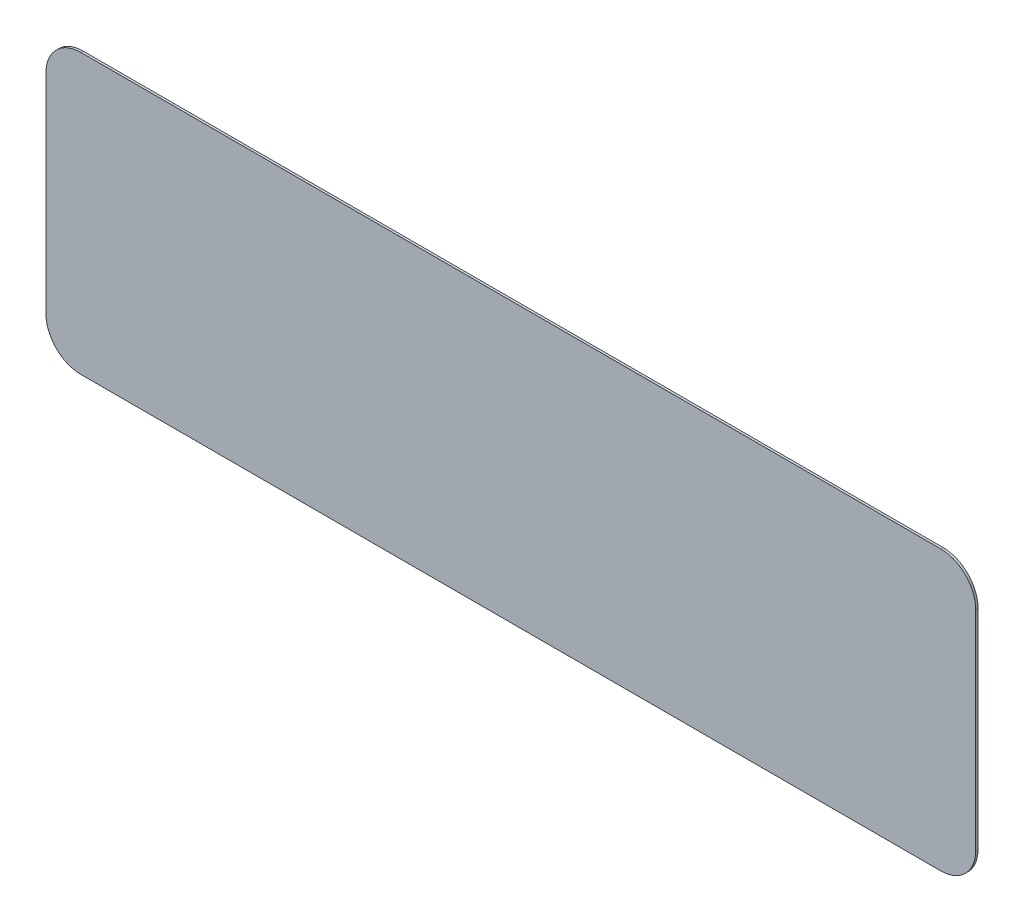
ISO-10303-21;
HEADER;
FILE_DESCRIPTION(('STEP AP214'),'2;1');
FILE_NAME('part.step','',(''),(''),'','','');
FILE_SCHEMA(('AUTOMOTIVE_DESIGN { 1 0 10303 214 1 1 1 1 }'));
ENDSEC;
DATA;
#1=APPLICATION_CONTEXT('core data for automotive mechanical design processes');
#2=APPLICATION_PROTOCOL_DEFINITION('international standard','automotive_design',2000,#1);
#3=PRODUCT_CONTEXT('',#1,'mechanical');
#4=PRODUCT('Part','Part','',(#3));
#5=PRODUCT_RELATED_PRODUCT_CATEGORY('part','',(#4));
#6=PRODUCT_DEFINITION_FORMATION('','',#4);
#7=PRODUCT_DEFINITION_CONTEXT('part definition',#1,'design');
#8=PRODUCT_DEFINITION('design','',#6,#7);
#9=PRODUCT_DEFINITION_SHAPE('','',#8);
#10=(LENGTH_UNIT() NAMED_UNIT(*) SI_UNIT(.MILLI.,.METRE.));
#11=(NAMED_UNIT(*) PLANE_ANGLE_UNIT() SI_UNIT($,.RADIAN.));
#12=(NAMED_UNIT(*) SI_UNIT($,.STERADIAN.) SOLID_ANGLE_UNIT());
#13=UNCERTAINTY_MEASURE_WITH_UNIT(LENGTH_MEASURE(1.E-05),#10,'distance_accuracy_value','');
#14=(GEOMETRIC_REPRESENTATION_CONTEXT(3) GLOBAL_UNCERTAINTY_ASSIGNED_CONTEXT((#13)) GLOBAL_UNIT_ASSIGNED_CONTEXT((#10,
#11,#12)) REPRESENTATION_CONTEXT('',''));
#15=CARTESIAN_POINT('',(0.,0.,0.));
#16=DIRECTION('',(0.,0.,1.));
#17=DIRECTION('',(1.,0.,0.));
#18=AXIS2_PLACEMENT_3D('',#15,#16,#17);
#19=CARTESIAN_POINT('',(18.5,10.5,0.1));
#20=DIRECTION('',(0.,0.,-1.));
#21=DIRECTION('',(-1.,0.,0.));
#22=AXIS2_PLACEMENT_3D('',#19,#20,#21);
#23=CYLINDRICAL_SURFACE('',#22,1.5);
#24=CARTESIAN_POINT('',(18.5,10.5,0.));
#25=DIRECTION('',(0.,0.,1.));
#26=DIRECTION('',(-1.,0.,0.));
#27=AXIS2_PLACEMENT_3D('',#24,#25,#26);
#28=CIRCLE('',#27,1.5);
#29=CARTESIAN_POINT('',(20.,10.5,0.));
#30=VERTEX_POINT('',#29);
#31=CARTESIAN_POINT('',(18.5,12.,0.));
#32=VERTEX_POINT('',#31);
#33=EDGE_CURVE('E129',#30,#32,#28,.T.);
#34=ORIENTED_EDGE('',*,*,#33,.T.);
#35=DIRECTION('',(0.,0.,-1.));
#36=VECTOR('',#35,1.);
#37=CARTESIAN_POINT('',(18.5,12.,0.1));
#38=LINE('',#37,#36);
#39=CARTESIAN_POINT('',(18.5,12.,0.1));
#40=VERTEX_POINT('',#39);
#41=EDGE_CURVE('E11',#40,#32,#38,.T.);
#42=ORIENTED_EDGE('',*,*,#41,.F.);
#43=CARTESIAN_POINT('',(18.5,10.5,0.1));
#44=DIRECTION('',(0.,0.,1.));
#45=DIRECTION('',(-1.,0.,0.));
#46=AXIS2_PLACEMENT_3D('',#43,#44,#45);
#47=CIRCLE('',#46,1.5);
#48=CARTESIAN_POINT('',(20.,10.5,0.1));
#49=VERTEX_POINT('',#48);
#50=EDGE_CURVE('E143',#49,#40,#47,.T.);
#51=ORIENTED_EDGE('',*,*,#50,.F.);
#52=DIRECTION('',(0.,0.,-1.));
#53=VECTOR('',#52,1.);
#54=CARTESIAN_POINT('',(20.,10.5,0.1));
#55=LINE('',#54,#53);
#56=EDGE_CURVE('E125',#49,#30,#55,.T.);
#57=ORIENTED_EDGE('',*,*,#56,.T.);
#58=EDGE_LOOP('',(#34,#42,#51,#57));
#59=FACE_BOUND('',#58,.T.);
#60=ADVANCED_FACE('F33',(#59),#23,.T.);
#61=CARTESIAN_POINT('',(-18.5,12.,0.1));
#62=DIRECTION('',(0.,-1.,0.));
#63=DIRECTION('',(0.,0.,-1.));
#64=AXIS2_PLACEMENT_3D('',#61,#62,#63);
#65=PLANE('',#64);
#66=DIRECTION('',(-1.,0.,0.));
#67=VECTOR('',#66,1.);
#68=CARTESIAN_POINT('',(-18.5,12.,0.));
#69=LINE('',#68,#67);
#70=CARTESIAN_POINT('',(-18.5,12.,0.));
#71=VERTEX_POINT('',#70);
#72=EDGE_CURVE('E132',#32,#71,#69,.T.);
#73=ORIENTED_EDGE('',*,*,#72,.T.);
#74=DIRECTION('',(0.,0.,-1.));
#75=VECTOR('',#74,1.);
#76=CARTESIAN_POINT('',(-18.5,12.,0.1));
#77=LINE('',#76,#75);
#78=CARTESIAN_POINT('',(-18.5,12.,0.1));
#79=VERTEX_POINT('',#78);
#80=EDGE_CURVE('E41',#79,#71,#77,.T.);
#81=ORIENTED_EDGE('',*,*,#80,.F.);
#82=DIRECTION('',(-1.,0.,0.));
#83=VECTOR('',#82,1.);
#84=CARTESIAN_POINT('',(-18.5,12.,0.1));
#85=LINE('',#84,#83);
#86=EDGE_CURVE('E92',#40,#79,#85,.T.);
#87=ORIENTED_EDGE('',*,*,#86,.F.);
#88=ORIENTED_EDGE('',*,*,#41,.T.);
#89=EDGE_LOOP('',(#73,#81,#87,#88));
#90=FACE_BOUND('',#89,.T.);
#91=ADVANCED_FACE('F178',(#90),#65,.F.);
#92=CARTESIAN_POINT('',(-18.5,10.5,0.1));
#93=DIRECTION('',(0.,0.,-1.));
#94=DIRECTION('',(-1.,0.,0.));
#95=AXIS2_PLACEMENT_3D('',#92,#93,#94);
#96=CYLINDRICAL_SURFACE('',#95,1.5);
#97=CARTESIAN_POINT('',(-18.5,10.5,0.));
#98=DIRECTION('',(0.,0.,1.));
#99=DIRECTION('',(-1.,0.,0.));
#100=AXIS2_PLACEMENT_3D('',#97,#98,#99);
#101=CIRCLE('',#100,1.5);
#102=CARTESIAN_POINT('',(-20.,10.5,0.));
#103=VERTEX_POINT('',#102);
#104=EDGE_CURVE('E134',#71,#103,#101,.T.);
#105=ORIENTED_EDGE('',*,*,#104,.T.);
#106=DIRECTION('',(0.,0.,-1.));
#107=VECTOR('',#106,1.);
#108=CARTESIAN_POINT('',(-20.,10.5,0.1));
#109=LINE('',#108,#107);
#110=CARTESIAN_POINT('',(-20.,10.5,0.1));
#111=VERTEX_POINT('',#110);
#112=EDGE_CURVE('E150',#111,#103,#109,.T.);
#113=ORIENTED_EDGE('',*,*,#112,.F.);
#114=CARTESIAN_POINT('',(-18.5,10.5,0.1));
#115=DIRECTION('',(0.,0.,1.));
#116=DIRECTION('',(-1.,0.,0.));
#117=AXIS2_PLACEMENT_3D('',#114,#115,#116);
#118=CIRCLE('',#117,1.5);
#119=EDGE_CURVE('E158',#79,#111,#118,.T.);
#120=ORIENTED_EDGE('',*,*,#119,.F.);
#121=ORIENTED_EDGE('',*,*,#80,.T.);
#122=EDGE_LOOP('',(#105,#113,#120,#121));
#123=FACE_BOUND('',#122,.T.);
#124=ADVANCED_FACE('F156',(#123),#96,.T.);
#125=CARTESIAN_POINT('',(-20.,1.5,0.1));
#126=DIRECTION('',(1.,0.,0.));
#127=DIRECTION('',(0.,0.,-1.));
#128=AXIS2_PLACEMENT_3D('',#125,#126,#127);
#129=PLANE('',#128);
#130=DIRECTION('',(0.,-1.,0.));
#131=VECTOR('',#130,1.);
#132=CARTESIAN_POINT('',(-20.,1.5,0.));
#133=LINE('',#132,#131);
#134=CARTESIAN_POINT('',(-20.,1.5,0.));
#135=VERTEX_POINT('',#134);
#136=EDGE_CURVE('E136',#103,#135,#133,.T.);
#137=ORIENTED_EDGE('',*,*,#136,.T.);
#138=DIRECTION('',(0.,0.,-1.));
#139=VECTOR('',#138,1.);
#140=CARTESIAN_POINT('',(-20.,1.5,0.1));
#141=LINE('',#140,#139);
#142=CARTESIAN_POINT('',(-20.,1.5,0.1));
#143=VERTEX_POINT('',#142);
#144=EDGE_CURVE('E147',#143,#135,#141,.T.);
#145=ORIENTED_EDGE('',*,*,#144,.F.);
#146=DIRECTION('',(0.,-1.,0.));
#147=VECTOR('',#146,1.);
#148=CARTESIAN_POINT('',(-20.,1.5,0.1));
#149=LINE('',#148,#147);
#150=EDGE_CURVE('E170',#111,#143,#149,.T.);
#151=ORIENTED_EDGE('',*,*,#150,.F.);
#152=ORIENTED_EDGE('',*,*,#112,.T.);
#153=EDGE_LOOP('',(#137,#145,#151,#152));
#154=FACE_BOUND('',#153,.T.);
#155=ADVANCED_FACE('F166',(#154),#129,.F.);
#156=CARTESIAN_POINT('',(-18.5,1.5,0.1));
#157=DIRECTION('',(0.,0.,-1.));
#158=DIRECTION('',(-1.,0.,0.));
#159=AXIS2_PLACEMENT_3D('',#156,#157,#158);
#160=CYLINDRICAL_SURFACE('',#159,1.5);
#161=CARTESIAN_POINT('',(-18.5,1.5,0.));
#162=DIRECTION('',(0.,0.,1.));
#163=DIRECTION('',(-1.,0.,0.));
#164=AXIS2_PLACEMENT_3D('',#161,#162,#163);
#165=CIRCLE('',#164,1.5);
#166=CARTESIAN_POINT('',(-18.5,0.,0.));
#167=VERTEX_POINT('',#166);
#168=EDGE_CURVE('E138',#135,#167,#165,.T.);
#169=ORIENTED_EDGE('',*,*,#168,.T.);
#170=DIRECTION('',(0.,0.,-1.));
#171=VECTOR('',#170,1.);
#172=CARTESIAN_POINT('',(-18.5,0.,0.1));
#173=LINE('',#172,#171);
#174=CARTESIAN_POINT('',(-18.5,0.,0.1));
#175=VERTEX_POINT('',#174);
#176=EDGE_CURVE('E120',#175,#167,#173,.T.);
#177=ORIENTED_EDGE('',*,*,#176,.F.);
#178=CARTESIAN_POINT('',(-18.5,1.5,0.1));
#179=DIRECTION('',(0.,0.,1.));
#180=DIRECTION('',(-1.,0.,0.));
#181=AXIS2_PLACEMENT_3D('',#178,#179,#180);
#182=CIRCLE('',#181,1.5);
#183=EDGE_CURVE('E111',#143,#175,#182,.T.);
#184=ORIENTED_EDGE('',*,*,#183,.F.);
#185=ORIENTED_EDGE('',*,*,#144,.T.);
#186=EDGE_LOOP('',(#169,#177,#184,#185));
#187=FACE_BOUND('',#186,.T.);
#188=ADVANCED_FACE('F169',(#187),#160,.T.);
#189=CARTESIAN_POINT('',(-18.5,0.,0.1));
#190=DIRECTION('',(0.,1.,0.));
#191=DIRECTION('',(0.,0.,1.));
#192=AXIS2_PLACEMENT_3D('',#189,#190,#191);
#193=PLANE('',#192);
#194=DIRECTION('',(1.,0.,0.));
#195=VECTOR('',#194,1.);
#196=CARTESIAN_POINT('',(-18.5,0.,0.));
#197=LINE('',#196,#195);
#198=CARTESIAN_POINT('',(18.5,0.,0.));
#199=VERTEX_POINT('',#198);
#200=EDGE_CURVE('E119',#167,#199,#197,.T.);
#201=ORIENTED_EDGE('',*,*,#200,.T.);
#202=DIRECTION('',(0.,0.,-1.));
#203=VECTOR('',#202,1.);
#204=CARTESIAN_POINT('',(18.5,0.,0.1));
#205=LINE('',#204,#203);
#206=CARTESIAN_POINT('',(18.5,0.,0.1));
#207=VERTEX_POINT('',#206);
#208=EDGE_CURVE('E116',#207,#199,#205,.T.);
#209=ORIENTED_EDGE('',*,*,#208,.F.);
#210=DIRECTION('',(1.,0.,0.));
#211=VECTOR('',#210,1.);
#212=CARTESIAN_POINT('',(-18.5,0.,0.1));
#213=LINE('',#212,#211);
#214=EDGE_CURVE('E105',#175,#207,#213,.T.);
#215=ORIENTED_EDGE('',*,*,#214,.F.);
#216=ORIENTED_EDGE('',*,*,#176,.T.);
#217=EDGE_LOOP('',(#201,#209,#215,#216));
#218=FACE_BOUND('',#217,.T.);
#219=ADVANCED_FACE('F117',(#218),#193,.F.);
#220=CARTESIAN_POINT('',(18.5,1.5,0.1));
#221=DIRECTION('',(0.,0.,-1.));
#222=DIRECTION('',(-1.,0.,0.));
#223=AXIS2_PLACEMENT_3D('',#220,#221,#222);
#224=CYLINDRICAL_SURFACE('',#223,1.5);
#225=CARTESIAN_POINT('',(18.5,1.5,0.));
#226=DIRECTION('',(0.,0.,1.));
#227=DIRECTION('',(1.,0.,0.));
#228=AXIS2_PLACEMENT_3D('',#225,#226,#227);
#229=CIRCLE('',#228,1.5);
#230=CARTESIAN_POINT('',(20.,1.5,0.));
#231=VERTEX_POINT('',#230);
#232=EDGE_CURVE('E78',#199,#231,#229,.T.);
#233=ORIENTED_EDGE('',*,*,#232,.T.);
#234=DIRECTION('',(0.,0.,-1.));
#235=VECTOR('',#234,1.);
#236=CARTESIAN_POINT('',(20.,1.5,0.1));
#237=LINE('',#236,#235);
#238=CARTESIAN_POINT('',(20.,1.5,0.1));
#239=VERTEX_POINT('',#238);
#240=EDGE_CURVE('E121',#239,#231,#237,.T.);
#241=ORIENTED_EDGE('',*,*,#240,.F.);
#242=CARTESIAN_POINT('',(18.5,1.5,0.1));
#243=DIRECTION('',(0.,0.,1.));
#244=DIRECTION('',(1.,0.,0.));
#245=AXIS2_PLACEMENT_3D('',#242,#243,#244);
#246=CIRCLE('',#245,1.5);
#247=EDGE_CURVE('E109',#207,#239,#246,.T.);
#248=ORIENTED_EDGE('',*,*,#247,.F.);
#249=ORIENTED_EDGE('',*,*,#208,.T.);
#250=EDGE_LOOP('',(#233,#241,#248,#249));
#251=FACE_BOUND('',#250,.T.);
#252=ADVANCED_FACE('F123',(#251),#224,.T.);
#253=CARTESIAN_POINT('',(20.,1.5,0.1));
#254=DIRECTION('',(-1.,0.,0.));
#255=DIRECTION('',(0.,0.,1.));
#256=AXIS2_PLACEMENT_3D('',#253,#254,#255);
#257=PLANE('',#256);
#258=DIRECTION('',(0.,1.,0.));
#259=VECTOR('',#258,1.);
#260=CARTESIAN_POINT('',(20.,1.5,0.));
#261=LINE('',#260,#259);
#262=EDGE_CURVE('E84',#231,#30,#261,.T.);
#263=ORIENTED_EDGE('',*,*,#262,.T.);
#264=ORIENTED_EDGE('',*,*,#56,.F.);
#265=DIRECTION('',(0.,1.,0.));
#266=VECTOR('',#265,1.);
#267=CARTESIAN_POINT('',(20.,1.5,0.1));
#268=LINE('',#267,#266);
#269=EDGE_CURVE('E49',#239,#49,#268,.T.);
#270=ORIENTED_EDGE('',*,*,#269,.F.);
#271=ORIENTED_EDGE('',*,*,#240,.T.);
#272=EDGE_LOOP('',(#263,#264,#270,#271));
#273=FACE_BOUND('',#272,.T.);
#274=ADVANCED_FACE('F194',(#273),#257,.F.);
#275=CARTESIAN_POINT('',(18.5,10.5,0.1));
#276=DIRECTION('',(0.,0.,-1.));
#277=DIRECTION('',(-1.,0.,0.));
#278=AXIS2_PLACEMENT_3D('',#275,#276,#277);
#279=PLANE('',#278);
#280=ORIENTED_EDGE('',*,*,#50,.T.);
#281=ORIENTED_EDGE('',*,*,#86,.T.);
#282=ORIENTED_EDGE('',*,*,#119,.T.);
#283=ORIENTED_EDGE('',*,*,#150,.T.);
#284=ORIENTED_EDGE('',*,*,#183,.T.);
#285=ORIENTED_EDGE('',*,*,#214,.T.);
#286=ORIENTED_EDGE('',*,*,#247,.T.);
#287=ORIENTED_EDGE('',*,*,#269,.T.);
#288=EDGE_LOOP('',(#280,#281,#282,#283,#284,#285,#286,#287));
#289=FACE_BOUND('',#288,.T.);
#290=ADVANCED_FACE('F107',(#289),#279,.F.);
#291=CARTESIAN_POINT('',(18.5,10.5,0.));
#292=DIRECTION('',(0.,0.,-1.));
#293=DIRECTION('',(-1.,0.,0.));
#294=AXIS2_PLACEMENT_3D('',#291,#292,#293);
#295=PLANE('',#294);
#296=ORIENTED_EDGE('',*,*,#33,.F.);
#297=ORIENTED_EDGE('',*,*,#262,.F.);
#298=ORIENTED_EDGE('',*,*,#232,.F.);
#299=ORIENTED_EDGE('',*,*,#200,.F.);
#300=ORIENTED_EDGE('',*,*,#168,.F.);
#301=ORIENTED_EDGE('',*,*,#136,.F.);
#302=ORIENTED_EDGE('',*,*,#104,.F.);
#303=ORIENTED_EDGE('',*,*,#72,.F.);
#304=EDGE_LOOP('',(#296,#297,#298,#299,#300,#301,#302,#303));
#305=FACE_BOUND('',#304,.T.);
#306=ADVANCED_FACE('F162',(#305),#295,.T.);
#307=CLOSED_SHELL('',(#60,#91,#124,#155,#188,#219,#252,#274,#290,#306));
#308=MANIFOLD_SOLID_BREP('B2',#307);
#309=ADVANCED_BREP_SHAPE_REPRESENTATION('',(#18,#308),#14);
#310=SHAPE_DEFINITION_REPRESENTATION(#9,#309);
ENDSEC;
END-ISO-10303-21;
